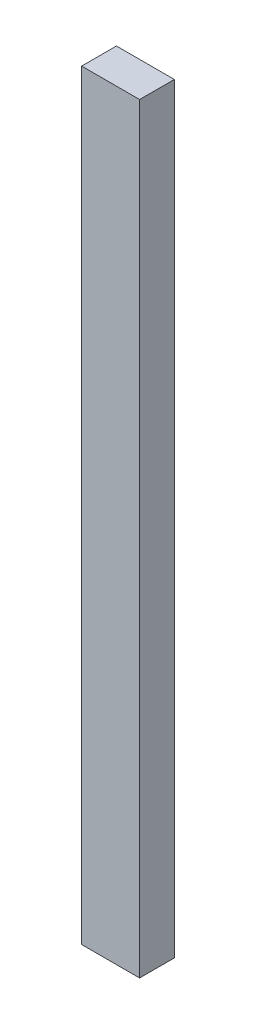
ISO-10303-21;
HEADER;
FILE_DESCRIPTION(('STEP AP214'),'2;1');
FILE_NAME('part.step','',(''),(''),'','','');
FILE_SCHEMA(('AUTOMOTIVE_DESIGN { 1 0 10303 214 1 1 1 1 }'));
ENDSEC;
DATA;
#1=APPLICATION_CONTEXT('core data for automotive mechanical design processes');
#2=APPLICATION_PROTOCOL_DEFINITION('international standard','automotive_design',2000,#1);
#3=PRODUCT_CONTEXT('',#1,'mechanical');
#4=PRODUCT('Part','Part','',(#3));
#5=PRODUCT_RELATED_PRODUCT_CATEGORY('part','',(#4));
#6=PRODUCT_DEFINITION_FORMATION('','',#4);
#7=PRODUCT_DEFINITION_CONTEXT('part definition',#1,'design');
#8=PRODUCT_DEFINITION('design','',#6,#7);
#9=PRODUCT_DEFINITION_SHAPE('','',#8);
#10=(LENGTH_UNIT() NAMED_UNIT(*) SI_UNIT(.MILLI.,.METRE.));
#11=(NAMED_UNIT(*) PLANE_ANGLE_UNIT() SI_UNIT($,.RADIAN.));
#12=(NAMED_UNIT(*) SI_UNIT($,.STERADIAN.) SOLID_ANGLE_UNIT());
#13=UNCERTAINTY_MEASURE_WITH_UNIT(LENGTH_MEASURE(1.E-05),#10,'distance_accuracy_value','');
#14=(GEOMETRIC_REPRESENTATION_CONTEXT(3) GLOBAL_UNCERTAINTY_ASSIGNED_CONTEXT((#13)) GLOBAL_UNIT_ASSIGNED_CONTEXT((#10,
#11,#12)) REPRESENTATION_CONTEXT('',''));
#15=CARTESIAN_POINT('',(0.,0.,0.));
#16=DIRECTION('',(0.,0.,1.));
#17=DIRECTION('',(1.,0.,0.));
#18=AXIS2_PLACEMENT_3D('',#15,#16,#17);
#19=CARTESIAN_POINT('',(15.,197.,18.));
#20=DIRECTION('',(-1.,0.,0.));
#21=DIRECTION('',(0.,-1.,0.));
#22=AXIS2_PLACEMENT_3D('',#19,#20,#21);
#23=PLANE('',#22);
#24=DIRECTION('',(0.,1.,0.));
#25=VECTOR('',#24,1.);
#26=CARTESIAN_POINT('',(15.,197.,0.));
#27=LINE('',#26,#25);
#28=CARTESIAN_POINT('',(15.,-197.,0.));
#29=VERTEX_POINT('',#28);
#30=CARTESIAN_POINT('',(15.,197.,0.));
#31=VERTEX_POINT('',#30);
#32=EDGE_CURVE('E96',#29,#31,#27,.T.);
#33=ORIENTED_EDGE('',*,*,#32,.T.);
#34=DIRECTION('',(0.,0.,-1.));
#35=VECTOR('',#34,1.);
#36=CARTESIAN_POINT('',(15.,197.,18.));
#37=LINE('',#36,#35);
#38=CARTESIAN_POINT('',(15.,197.,18.));
#39=VERTEX_POINT('',#38);
#40=EDGE_CURVE('E11',#39,#31,#37,.T.);
#41=ORIENTED_EDGE('',*,*,#40,.F.);
#42=DIRECTION('',(0.,1.,0.));
#43=VECTOR('',#42,1.);
#44=CARTESIAN_POINT('',(15.,197.,18.));
#45=LINE('',#44,#43);
#46=CARTESIAN_POINT('',(15.,-197.,18.));
#47=VERTEX_POINT('',#46);
#48=EDGE_CURVE('E84',#47,#39,#45,.T.);
#49=ORIENTED_EDGE('',*,*,#48,.F.);
#50=DIRECTION('',(0.,0.,-1.));
#51=VECTOR('',#50,1.);
#52=CARTESIAN_POINT('',(15.,-197.,18.));
#53=LINE('',#52,#51);
#54=EDGE_CURVE('E92',#47,#29,#53,.T.);
#55=ORIENTED_EDGE('',*,*,#54,.T.);
#56=EDGE_LOOP('',(#33,#41,#49,#55));
#57=FACE_BOUND('',#56,.T.);
#58=ADVANCED_FACE('F33',(#57),#23,.F.);
#59=CARTESIAN_POINT('',(-15.,197.,18.));
#60=DIRECTION('',(0.,-1.,0.));
#61=DIRECTION('',(0.,0.,-1.));
#62=AXIS2_PLACEMENT_3D('',#59,#60,#61);
#63=PLANE('',#62);
#64=DIRECTION('',(-1.,0.,0.));
#65=VECTOR('',#64,1.);
#66=CARTESIAN_POINT('',(-15.,197.,0.));
#67=LINE('',#66,#65);
#68=CARTESIAN_POINT('',(-15.,197.,0.));
#69=VERTEX_POINT('',#68);
#70=EDGE_CURVE('E88',#31,#69,#67,.T.);
#71=ORIENTED_EDGE('',*,*,#70,.T.);
#72=DIRECTION('',(0.,0.,-1.));
#73=VECTOR('',#72,1.);
#74=CARTESIAN_POINT('',(-15.,197.,18.));
#75=LINE('',#74,#73);
#76=CARTESIAN_POINT('',(-15.,197.,18.));
#77=VERTEX_POINT('',#76);
#78=EDGE_CURVE('E41',#77,#69,#75,.T.);
#79=ORIENTED_EDGE('',*,*,#78,.F.);
#80=DIRECTION('',(-1.,0.,0.));
#81=VECTOR('',#80,1.);
#82=CARTESIAN_POINT('',(-15.,197.,18.));
#83=LINE('',#82,#81);
#84=EDGE_CURVE('E79',#39,#77,#83,.T.);
#85=ORIENTED_EDGE('',*,*,#84,.F.);
#86=ORIENTED_EDGE('',*,*,#40,.T.);
#87=EDGE_LOOP('',(#71,#79,#85,#86));
#88=FACE_BOUND('',#87,.T.);
#89=ADVANCED_FACE('F87',(#88),#63,.F.);
#90=CARTESIAN_POINT('',(-15.,197.,18.));
#91=DIRECTION('',(1.,0.,0.));
#92=DIRECTION('',(0.,1.,0.));
#93=AXIS2_PLACEMENT_3D('',#90,#91,#92);
#94=PLANE('',#93);
#95=DIRECTION('',(0.,-1.,0.));
#96=VECTOR('',#95,1.);
#97=CARTESIAN_POINT('',(-15.,197.,0.));
#98=LINE('',#97,#96);
#99=CARTESIAN_POINT('',(-15.,-197.,0.));
#100=VERTEX_POINT('',#99);
#101=EDGE_CURVE('E66',#69,#100,#98,.T.);
#102=ORIENTED_EDGE('',*,*,#101,.T.);
#103=DIRECTION('',(0.,0.,-1.));
#104=VECTOR('',#103,1.);
#105=CARTESIAN_POINT('',(-15.,-197.,18.));
#106=LINE('',#105,#104);
#107=CARTESIAN_POINT('',(-15.,-197.,18.));
#108=VERTEX_POINT('',#107);
#109=EDGE_CURVE('E89',#108,#100,#106,.T.);
#110=ORIENTED_EDGE('',*,*,#109,.F.);
#111=DIRECTION('',(0.,-1.,0.));
#112=VECTOR('',#111,1.);
#113=CARTESIAN_POINT('',(-15.,197.,18.));
#114=LINE('',#113,#112);
#115=EDGE_CURVE('E82',#77,#108,#114,.T.);
#116=ORIENTED_EDGE('',*,*,#115,.F.);
#117=ORIENTED_EDGE('',*,*,#78,.T.);
#118=EDGE_LOOP('',(#102,#110,#116,#117));
#119=FACE_BOUND('',#118,.T.);
#120=ADVANCED_FACE('F90',(#119),#94,.F.);
#121=CARTESIAN_POINT('',(-15.,-197.,18.));
#122=DIRECTION('',(0.,1.,0.));
#123=DIRECTION('',(0.,0.,1.));
#124=AXIS2_PLACEMENT_3D('',#121,#122,#123);
#125=PLANE('',#124);
#126=DIRECTION('',(1.,0.,0.));
#127=VECTOR('',#126,1.);
#128=CARTESIAN_POINT('',(-15.,-197.,0.));
#129=LINE('',#128,#127);
#130=EDGE_CURVE('E72',#100,#29,#129,.T.);
#131=ORIENTED_EDGE('',*,*,#130,.T.);
#132=ORIENTED_EDGE('',*,*,#54,.F.);
#133=DIRECTION('',(1.,0.,0.));
#134=VECTOR('',#133,1.);
#135=CARTESIAN_POINT('',(-15.,-197.,18.));
#136=LINE('',#135,#134);
#137=EDGE_CURVE('E49',#108,#47,#136,.T.);
#138=ORIENTED_EDGE('',*,*,#137,.F.);
#139=ORIENTED_EDGE('',*,*,#109,.T.);
#140=EDGE_LOOP('',(#131,#132,#138,#139));
#141=FACE_BOUND('',#140,.T.);
#142=ADVANCED_FACE('F103',(#141),#125,.F.);
#143=CARTESIAN_POINT('',(0.,0.,18.));
#144=DIRECTION('',(0.,0.,1.));
#145=DIRECTION('',(1.,0.,0.));
#146=AXIS2_PLACEMENT_3D('',#143,#144,#145);
#147=PLANE('',#146);
#148=ORIENTED_EDGE('',*,*,#48,.T.);
#149=ORIENTED_EDGE('',*,*,#84,.T.);
#150=ORIENTED_EDGE('',*,*,#115,.T.);
#151=ORIENTED_EDGE('',*,*,#137,.T.);
#152=EDGE_LOOP('',(#148,#149,#150,#151));
#153=FACE_BOUND('',#152,.T.);
#154=ADVANCED_FACE('F80',(#153),#147,.T.);
#155=CARTESIAN_POINT('',(0.,0.,0.));
#156=DIRECTION('',(0.,0.,1.));
#157=DIRECTION('',(1.,0.,0.));
#158=AXIS2_PLACEMENT_3D('',#155,#156,#157);
#159=PLANE('',#158);
#160=ORIENTED_EDGE('',*,*,#32,.F.);
#161=ORIENTED_EDGE('',*,*,#130,.F.);
#162=ORIENTED_EDGE('',*,*,#101,.F.);
#163=ORIENTED_EDGE('',*,*,#70,.F.);
#164=EDGE_LOOP('',(#160,#161,#162,#163));
#165=FACE_BOUND('',#164,.T.);
#166=ADVANCED_FACE('F106',(#165),#159,.F.);
#167=CLOSED_SHELL('',(#58,#89,#120,#142,#154,#166));
#168=MANIFOLD_SOLID_BREP('B2',#167);
#169=ADVANCED_BREP_SHAPE_REPRESENTATION('',(#18,#168),#14);
#170=SHAPE_DEFINITION_REPRESENTATION(#9,#169);
ENDSEC;
END-ISO-10303-21;
